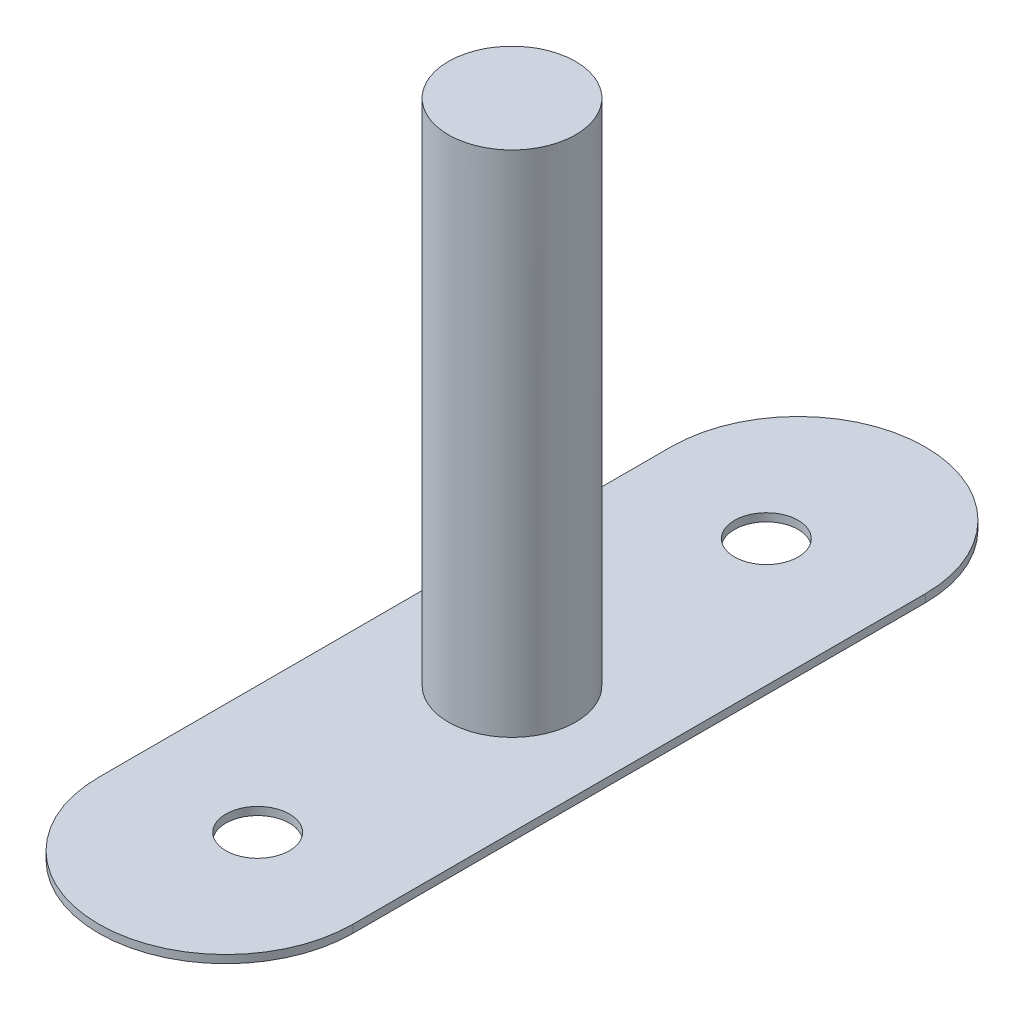
ISO-10303-21;
HEADER;
FILE_DESCRIPTION(('STEP AP214'),'2;1');
FILE_NAME('part.step','',(''),(''),'','','');
FILE_SCHEMA(('AUTOMOTIVE_DESIGN { 1 0 10303 214 1 1 1 1 }'));
ENDSEC;
DATA;
#1=APPLICATION_CONTEXT('core data for automotive mechanical design processes');
#2=APPLICATION_PROTOCOL_DEFINITION('international standard','automotive_design',2000,#1);
#3=PRODUCT_CONTEXT('',#1,'mechanical');
#4=PRODUCT('Part','Part','',(#3));
#5=PRODUCT_RELATED_PRODUCT_CATEGORY('part','',(#4));
#6=PRODUCT_DEFINITION_FORMATION('','',#4);
#7=PRODUCT_DEFINITION_CONTEXT('part definition',#1,'design');
#8=PRODUCT_DEFINITION('design','',#6,#7);
#9=PRODUCT_DEFINITION_SHAPE('','',#8);
#10=(LENGTH_UNIT() NAMED_UNIT(*) SI_UNIT(.MILLI.,.METRE.));
#11=(NAMED_UNIT(*) PLANE_ANGLE_UNIT() SI_UNIT($,.RADIAN.));
#12=(NAMED_UNIT(*) SI_UNIT($,.STERADIAN.) SOLID_ANGLE_UNIT());
#13=UNCERTAINTY_MEASURE_WITH_UNIT(LENGTH_MEASURE(1.E-05),#10,'distance_accuracy_value','');
#14=(GEOMETRIC_REPRESENTATION_CONTEXT(3) GLOBAL_UNCERTAINTY_ASSIGNED_CONTEXT((#13)) GLOBAL_UNIT_ASSIGNED_CONTEXT((#10,
#11,#12)) REPRESENTATION_CONTEXT('',''));
#15=CARTESIAN_POINT('',(0.,0.,0.));
#16=DIRECTION('',(0.,0.,1.));
#17=DIRECTION('',(1.,0.,0.));
#18=AXIS2_PLACEMENT_3D('',#15,#16,#17);
#19=CARTESIAN_POINT('',(0.,0.79375,-28.575));
#20=DIRECTION('',(0.,-1.,0.));
#21=DIRECTION('',(0.,0.,-1.));
#22=AXIS2_PLACEMENT_3D('',#19,#20,#21);
#23=PLANE('',#22);
#24=CARTESIAN_POINT('',(0.,0.79375,-25.4));
#25=DIRECTION('',(0.,1.,0.));
#26=DIRECTION('',(0.,0.,1.));
#27=AXIS2_PLACEMENT_3D('',#24,#25,#26);
#28=CIRCLE('',#27,3.175);
#29=CARTESIAN_POINT('',(0.,0.79375,-22.225));
#30=VERTEX_POINT('',#29);
#31=EDGE_CURVE('E112',#30,#30,#28,.T.);
#32=ORIENTED_EDGE('',*,*,#31,.F.);
#33=EDGE_LOOP('',(#32));
#34=FACE_BOUND('',#33,.T.);
#35=CARTESIAN_POINT('',(0.,0.79375,-28.575));
#36=DIRECTION('',(0.,1.,0.));
#37=DIRECTION('',(0.,0.,-1.));
#38=AXIS2_PLACEMENT_3D('',#35,#36,#37);
#39=CIRCLE('',#38,12.7);
#40=CARTESIAN_POINT('',(12.7,0.79375,-28.575));
#41=VERTEX_POINT('',#40);
#42=CARTESIAN_POINT('',(-12.7,0.79375,-28.575));
#43=VERTEX_POINT('',#42);
#44=EDGE_CURVE('E88',#41,#43,#39,.T.);
#45=ORIENTED_EDGE('',*,*,#44,.T.);
#46=DIRECTION('',(0.,0.,1.));
#47=VECTOR('',#46,1.);
#48=CARTESIAN_POINT('',(-12.7,0.79375,28.575));
#49=LINE('',#48,#47);
#50=CARTESIAN_POINT('',(-12.7,0.79375,28.575));
#51=VERTEX_POINT('',#50);
#52=EDGE_CURVE('E83',#43,#51,#49,.T.);
#53=ORIENTED_EDGE('',*,*,#52,.T.);
#54=CARTESIAN_POINT('',(0.,0.79375,28.575));
#55=DIRECTION('',(0.,1.,0.));
#56=DIRECTION('',(0.,0.,1.));
#57=AXIS2_PLACEMENT_3D('',#54,#55,#56);
#58=CIRCLE('',#57,12.7);
#59=CARTESIAN_POINT('',(12.7,0.79375,28.575));
#60=VERTEX_POINT('',#59);
#61=EDGE_CURVE('E86',#51,#60,#58,.T.);
#62=ORIENTED_EDGE('',*,*,#61,.T.);
#63=DIRECTION('',(0.,0.,-1.));
#64=VECTOR('',#63,1.);
#65=CARTESIAN_POINT('',(12.7,0.79375,-28.575));
#66=LINE('',#65,#64);
#67=EDGE_CURVE('E52',#60,#41,#66,.T.);
#68=ORIENTED_EDGE('',*,*,#67,.T.);
#69=EDGE_LOOP('',(#45,#53,#62,#68));
#70=FACE_BOUND('',#69,.T.);
#71=CARTESIAN_POINT('',(0.,0.79375,25.4));
#72=DIRECTION('',(0.,1.,0.));
#73=DIRECTION('',(0.,0.,1.));
#74=AXIS2_PLACEMENT_3D('',#71,#72,#73);
#75=CIRCLE('',#74,3.175);
#76=CARTESIAN_POINT('',(0.,0.79375,28.575));
#77=VERTEX_POINT('',#76);
#78=EDGE_CURVE('E121',#77,#77,#75,.T.);
#79=ORIENTED_EDGE('',*,*,#78,.F.);
#80=EDGE_LOOP('',(#79));
#81=FACE_BOUND('',#80,.T.);
#82=CARTESIAN_POINT('',(0.,0.793750000000003,0.));
#83=DIRECTION('',(0.,-1.,0.));
#84=DIRECTION('',(0.,0.,-1.));
#85=AXIS2_PLACEMENT_3D('',#82,#83,#84);
#86=CIRCLE('',#85,6.35);
#87=CARTESIAN_POINT('',(0.,0.793750000000003,-6.35));
#88=VERTEX_POINT('',#87);
#89=EDGE_CURVE('E11',#88,#88,#86,.F.);
#90=ORIENTED_EDGE('',*,*,#89,.F.);
#91=EDGE_LOOP('',(#90));
#92=FACE_BOUND('',#91,.T.);
#93=ADVANCED_FACE('F35',(#34,#70,#81,#92),#23,.F.);
#94=CARTESIAN_POINT('',(0.,0.,-28.575));
#95=DIRECTION('',(0.,-1.,0.));
#96=DIRECTION('',(0.,0.,-1.));
#97=AXIS2_PLACEMENT_3D('',#94,#95,#96);
#98=PLANE('',#97);
#99=CARTESIAN_POINT('',(0.,0.,25.4));
#100=DIRECTION('',(0.,-1.,0.));
#101=DIRECTION('',(0.,0.,-1.));
#102=AXIS2_PLACEMENT_3D('',#99,#100,#101);
#103=CIRCLE('',#102,3.175);
#104=CARTESIAN_POINT('',(0.,0.,22.225));
#105=VERTEX_POINT('',#104);
#106=EDGE_CURVE('E116',#105,#105,#103,.T.);
#107=ORIENTED_EDGE('',*,*,#106,.F.);
#108=EDGE_LOOP('',(#107));
#109=FACE_BOUND('',#108,.T.);
#110=CARTESIAN_POINT('',(0.,0.,-28.575));
#111=DIRECTION('',(0.,1.,0.));
#112=DIRECTION('',(0.,0.,-1.));
#113=AXIS2_PLACEMENT_3D('',#110,#111,#112);
#114=CIRCLE('',#113,12.7);
#115=CARTESIAN_POINT('',(12.7,0.,-28.575));
#116=VERTEX_POINT('',#115);
#117=CARTESIAN_POINT('',(-12.7,0.,-28.575));
#118=VERTEX_POINT('',#117);
#119=EDGE_CURVE('E102',#116,#118,#114,.T.);
#120=ORIENTED_EDGE('',*,*,#119,.F.);
#121=DIRECTION('',(0.,0.,-1.));
#122=VECTOR('',#121,1.);
#123=CARTESIAN_POINT('',(12.7,0.,-28.575));
#124=LINE('',#123,#122);
#125=CARTESIAN_POINT('',(12.7,0.,28.575));
#126=VERTEX_POINT('',#125);
#127=EDGE_CURVE('E75',#126,#116,#124,.T.);
#128=ORIENTED_EDGE('',*,*,#127,.F.);
#129=CARTESIAN_POINT('',(0.,0.,28.575));
#130=DIRECTION('',(0.,1.,0.));
#131=DIRECTION('',(0.,0.,1.));
#132=AXIS2_PLACEMENT_3D('',#129,#130,#131);
#133=CIRCLE('',#132,12.7);
#134=CARTESIAN_POINT('',(-12.7,0.,28.575));
#135=VERTEX_POINT('',#134);
#136=EDGE_CURVE('E69',#135,#126,#133,.T.);
#137=ORIENTED_EDGE('',*,*,#136,.F.);
#138=DIRECTION('',(0.,0.,1.));
#139=VECTOR('',#138,1.);
#140=CARTESIAN_POINT('',(-12.7,0.,28.575));
#141=LINE('',#140,#139);
#142=EDGE_CURVE('E93',#118,#135,#141,.T.);
#143=ORIENTED_EDGE('',*,*,#142,.F.);
#144=EDGE_LOOP('',(#120,#128,#137,#143));
#145=FACE_BOUND('',#144,.T.);
#146=CARTESIAN_POINT('',(0.,0.,-25.4));
#147=DIRECTION('',(0.,-1.,0.));
#148=DIRECTION('',(0.,0.,-1.));
#149=AXIS2_PLACEMENT_3D('',#146,#147,#148);
#150=CIRCLE('',#149,3.175);
#151=CARTESIAN_POINT('',(0.,0.,-28.575));
#152=VERTEX_POINT('',#151);
#153=EDGE_CURVE('E105',#152,#152,#150,.T.);
#154=ORIENTED_EDGE('',*,*,#153,.F.);
#155=EDGE_LOOP('',(#154));
#156=FACE_BOUND('',#155,.T.);
#157=ADVANCED_FACE('F140',(#109,#145,#156),#98,.T.);
#158=CARTESIAN_POINT('',(0.,0.79375,-28.575));
#159=DIRECTION('',(0.,-1.,0.));
#160=DIRECTION('',(0.,0.,-1.));
#161=AXIS2_PLACEMENT_3D('',#158,#159,#160);
#162=CYLINDRICAL_SURFACE('',#161,12.7);
#163=ORIENTED_EDGE('',*,*,#119,.T.);
#164=DIRECTION('',(0.,-1.,0.));
#165=VECTOR('',#164,1.);
#166=CARTESIAN_POINT('',(-12.7,0.79375,-28.575));
#167=LINE('',#166,#165);
#168=EDGE_CURVE('E44',#43,#118,#167,.T.);
#169=ORIENTED_EDGE('',*,*,#168,.F.);
#170=ORIENTED_EDGE('',*,*,#44,.F.);
#171=DIRECTION('',(0.,-1.,0.));
#172=VECTOR('',#171,1.);
#173=CARTESIAN_POINT('',(12.7,0.79375,-28.575));
#174=LINE('',#173,#172);
#175=EDGE_CURVE('E98',#41,#116,#174,.T.);
#176=ORIENTED_EDGE('',*,*,#175,.T.);
#177=EDGE_LOOP('',(#163,#169,#170,#176));
#178=FACE_BOUND('',#177,.T.);
#179=ADVANCED_FACE('F37',(#178),#162,.T.);
#180=CARTESIAN_POINT('',(-12.7,0.79375,28.575));
#181=DIRECTION('',(1.,0.,0.));
#182=DIRECTION('',(0.,0.,-1.));
#183=AXIS2_PLACEMENT_3D('',#180,#181,#182);
#184=PLANE('',#183);
#185=ORIENTED_EDGE('',*,*,#142,.T.);
#186=DIRECTION('',(0.,-1.,0.));
#187=VECTOR('',#186,1.);
#188=CARTESIAN_POINT('',(-12.7,0.79375,28.575));
#189=LINE('',#188,#187);
#190=EDGE_CURVE('E91',#51,#135,#189,.T.);
#191=ORIENTED_EDGE('',*,*,#190,.F.);
#192=ORIENTED_EDGE('',*,*,#52,.F.);
#193=ORIENTED_EDGE('',*,*,#168,.T.);
#194=EDGE_LOOP('',(#185,#191,#192,#193));
#195=FACE_BOUND('',#194,.T.);
#196=ADVANCED_FACE('F92',(#195),#184,.F.);
#197=CARTESIAN_POINT('',(0.,0.79375,28.575));
#198=DIRECTION('',(0.,-1.,0.));
#199=DIRECTION('',(0.,0.,-1.));
#200=AXIS2_PLACEMENT_3D('',#197,#198,#199);
#201=CYLINDRICAL_SURFACE('',#200,12.7);
#202=ORIENTED_EDGE('',*,*,#136,.T.);
#203=DIRECTION('',(0.,-1.,0.));
#204=VECTOR('',#203,1.);
#205=CARTESIAN_POINT('',(12.7,0.79375,28.575));
#206=LINE('',#205,#204);
#207=EDGE_CURVE('E94',#60,#126,#206,.T.);
#208=ORIENTED_EDGE('',*,*,#207,.F.);
#209=ORIENTED_EDGE('',*,*,#61,.F.);
#210=ORIENTED_EDGE('',*,*,#190,.T.);
#211=EDGE_LOOP('',(#202,#208,#209,#210));
#212=FACE_BOUND('',#211,.T.);
#213=ADVANCED_FACE('F96',(#212),#201,.T.);
#214=CARTESIAN_POINT('',(12.7,0.79375,-28.575));
#215=DIRECTION('',(-1.,0.,0.));
#216=DIRECTION('',(0.,0.,1.));
#217=AXIS2_PLACEMENT_3D('',#214,#215,#216);
#218=PLANE('',#217);
#219=ORIENTED_EDGE('',*,*,#127,.T.);
#220=ORIENTED_EDGE('',*,*,#175,.F.);
#221=ORIENTED_EDGE('',*,*,#67,.F.);
#222=ORIENTED_EDGE('',*,*,#207,.T.);
#223=EDGE_LOOP('',(#219,#220,#221,#222));
#224=FACE_BOUND('',#223,.T.);
#225=ADVANCED_FACE('F152',(#224),#218,.F.);
#226=CARTESIAN_POINT('',(0.,0.79375,-25.4));
#227=DIRECTION('',(0.,1.,0.));
#228=DIRECTION('',(0.,0.,1.));
#229=AXIS2_PLACEMENT_3D('',#226,#227,#228);
#230=CYLINDRICAL_SURFACE('',#229,3.175);
#231=ORIENTED_EDGE('',*,*,#153,.T.);
#232=EDGE_LOOP('',(#231));
#233=FACE_BOUND('',#232,.T.);
#234=ORIENTED_EDGE('',*,*,#31,.T.);
#235=EDGE_LOOP('',(#234));
#236=FACE_BOUND('',#235,.T.);
#237=ADVANCED_FACE('F149',(#233,#236),#230,.F.);
#238=CARTESIAN_POINT('',(0.,0.79375,25.4));
#239=DIRECTION('',(0.,1.,0.));
#240=DIRECTION('',(0.,0.,1.));
#241=AXIS2_PLACEMENT_3D('',#238,#239,#240);
#242=CYLINDRICAL_SURFACE('',#241,3.175);
#243=ORIENTED_EDGE('',*,*,#106,.T.);
#244=EDGE_LOOP('',(#243));
#245=FACE_BOUND('',#244,.T.);
#246=ORIENTED_EDGE('',*,*,#78,.T.);
#247=EDGE_LOOP('',(#246));
#248=FACE_BOUND('',#247,.T.);
#249=ADVANCED_FACE('F135',(#245,#248),#242,.F.);
#250=CARTESIAN_POINT('',(0.,51.59375,0.));
#251=DIRECTION('',(0.,-1.,0.));
#252=DIRECTION('',(0.,0.,-1.));
#253=AXIS2_PLACEMENT_3D('',#250,#251,#252);
#254=CYLINDRICAL_SURFACE('',#253,6.35);
#255=CARTESIAN_POINT('',(0.,51.59375,0.));
#256=DIRECTION('',(0.,1.,0.));
#257=DIRECTION('',(0.,0.,1.));
#258=AXIS2_PLACEMENT_3D('',#255,#256,#257);
#259=CIRCLE('',#258,6.35);
#260=CARTESIAN_POINT('',(0.,51.59375,6.35));
#261=VERTEX_POINT('',#260);
#262=EDGE_CURVE('E126',#261,#261,#259,.T.);
#263=ORIENTED_EDGE('',*,*,#262,.F.);
#264=EDGE_LOOP('',(#263));
#265=FACE_BOUND('',#264,.T.);
#266=ORIENTED_EDGE('',*,*,#89,.T.);
#267=EDGE_LOOP('',(#266));
#268=FACE_BOUND('',#267,.T.);
#269=ADVANCED_FACE('F132',(#265,#268),#254,.T.);
#270=CARTESIAN_POINT('',(0.,51.59375,0.));
#271=DIRECTION('',(0.,1.,0.));
#272=DIRECTION('',(0.,0.,1.));
#273=AXIS2_PLACEMENT_3D('',#270,#271,#272);
#274=PLANE('',#273);
#275=ORIENTED_EDGE('',*,*,#262,.T.);
#276=EDGE_LOOP('',(#275));
#277=FACE_BOUND('',#276,.T.);
#278=ADVANCED_FACE('F130',(#277),#274,.T.);
#279=CLOSED_SHELL('',(#93,#157,#179,#196,#213,#225,#237,#249,#269,#278));
#280=MANIFOLD_SOLID_BREP('B2',#279);
#281=ADVANCED_BREP_SHAPE_REPRESENTATION('',(#18,#280),#14);
#282=SHAPE_DEFINITION_REPRESENTATION(#9,#281);
ENDSEC;
END-ISO-10303-21;
